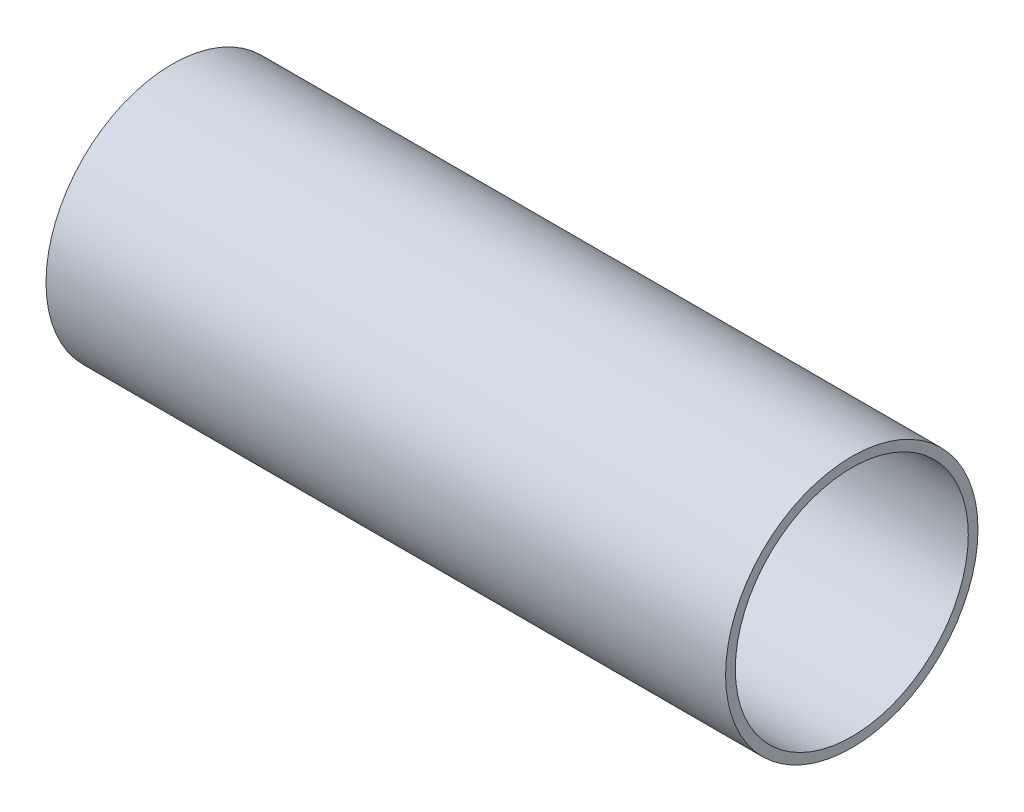
ISO-10303-21;
HEADER;
FILE_DESCRIPTION(('STEP AP214'),'2;1');
FILE_NAME('part.step','',(''),(''),'','','');
FILE_SCHEMA(('AUTOMOTIVE_DESIGN { 1 0 10303 214 1 1 1 1 }'));
ENDSEC;
DATA;
#1=APPLICATION_CONTEXT('core data for automotive mechanical design processes');
#2=APPLICATION_PROTOCOL_DEFINITION('international standard','automotive_design',2000,#1);
#3=PRODUCT_CONTEXT('',#1,'mechanical');
#4=PRODUCT('Part','Part','',(#3));
#5=PRODUCT_RELATED_PRODUCT_CATEGORY('part','',(#4));
#6=PRODUCT_DEFINITION_FORMATION('','',#4);
#7=PRODUCT_DEFINITION_CONTEXT('part definition',#1,'design');
#8=PRODUCT_DEFINITION('design','',#6,#7);
#9=PRODUCT_DEFINITION_SHAPE('','',#8);
#10=(LENGTH_UNIT() NAMED_UNIT(*) SI_UNIT(.MILLI.,.METRE.));
#11=(NAMED_UNIT(*) PLANE_ANGLE_UNIT() SI_UNIT($,.RADIAN.));
#12=(NAMED_UNIT(*) SI_UNIT($,.STERADIAN.) SOLID_ANGLE_UNIT());
#13=UNCERTAINTY_MEASURE_WITH_UNIT(LENGTH_MEASURE(1.E-05),#10,'distance_accuracy_value','');
#14=(GEOMETRIC_REPRESENTATION_CONTEXT(3) GLOBAL_UNCERTAINTY_ASSIGNED_CONTEXT((#13)) GLOBAL_UNIT_ASSIGNED_CONTEXT((#10,
#11,#12)) REPRESENTATION_CONTEXT('',''));
#15=CARTESIAN_POINT('',(0.,0.,0.));
#16=DIRECTION('',(0.,0.,1.));
#17=DIRECTION('',(1.,0.,0.));
#18=AXIS2_PLACEMENT_3D('',#15,#16,#17);
#19=CARTESIAN_POINT('',(350.,0.,0.));
#20=DIRECTION('',(1.,0.,0.));
#21=DIRECTION('',(0.,0.,-1.));
#22=AXIS2_PLACEMENT_3D('',#19,#20,#21);
#23=PLANE('',#22);
#24=CARTESIAN_POINT('',(350.,0.,0.));
#25=DIRECTION('',(1.,0.,0.));
#26=DIRECTION('',(0.,0.,-1.));
#27=AXIS2_PLACEMENT_3D('',#24,#25,#26);
#28=CIRCLE('',#27,65.);
#29=CARTESIAN_POINT('',(350.,0.,-65.));
#30=VERTEX_POINT('',#29);
#31=EDGE_CURVE('E10',#30,#30,#28,.T.);
#32=ORIENTED_EDGE('',*,*,#31,.T.);
#33=EDGE_LOOP('',(#32));
#34=FACE_BOUND('',#33,.T.);
#35=CARTESIAN_POINT('',(350.,0.,0.));
#36=DIRECTION('',(1.,0.,0.));
#37=DIRECTION('',(0.,0.,-1.));
#38=AXIS2_PLACEMENT_3D('',#35,#36,#37);
#39=CIRCLE('',#38,60.);
#40=CARTESIAN_POINT('',(350.,0.,-60.));
#41=VERTEX_POINT('',#40);
#42=EDGE_CURVE('E44',#41,#41,#39,.T.);
#43=ORIENTED_EDGE('',*,*,#42,.F.);
#44=EDGE_LOOP('',(#43));
#45=FACE_BOUND('',#44,.T.);
#46=ADVANCED_FACE('F33',(#34,#45),#23,.T.);
#47=CARTESIAN_POINT('',(0.,0.,0.));
#48=DIRECTION('',(1.,0.,0.));
#49=DIRECTION('',(0.,0.,-1.));
#50=AXIS2_PLACEMENT_3D('',#47,#48,#49);
#51=PLANE('',#50);
#52=CARTESIAN_POINT('',(0.,0.,0.));
#53=DIRECTION('',(1.,0.,0.));
#54=DIRECTION('',(0.,0.,-1.));
#55=AXIS2_PLACEMENT_3D('',#52,#53,#54);
#56=CIRCLE('',#55,65.);
#57=CARTESIAN_POINT('',(0.,0.,-65.));
#58=VERTEX_POINT('',#57);
#59=EDGE_CURVE('E37',#58,#58,#56,.T.);
#60=ORIENTED_EDGE('',*,*,#59,.F.);
#61=EDGE_LOOP('',(#60));
#62=FACE_BOUND('',#61,.T.);
#63=CARTESIAN_POINT('',(0.,0.,0.));
#64=DIRECTION('',(1.,0.,0.));
#65=DIRECTION('',(0.,0.,-1.));
#66=AXIS2_PLACEMENT_3D('',#63,#64,#65);
#67=CIRCLE('',#66,60.);
#68=CARTESIAN_POINT('',(0.,0.,-60.));
#69=VERTEX_POINT('',#68);
#70=EDGE_CURVE('E46',#69,#69,#67,.T.);
#71=ORIENTED_EDGE('',*,*,#70,.T.);
#72=EDGE_LOOP('',(#71));
#73=FACE_BOUND('',#72,.T.);
#74=ADVANCED_FACE('F56',(#62,#73),#51,.F.);
#75=CARTESIAN_POINT('',(350.,0.,0.));
#76=DIRECTION('',(-1.,0.,0.));
#77=DIRECTION('',(0.,0.,1.));
#78=AXIS2_PLACEMENT_3D('',#75,#76,#77);
#79=CYLINDRICAL_SURFACE('',#78,65.);
#80=ORIENTED_EDGE('',*,*,#31,.F.);
#81=EDGE_LOOP('',(#80));
#82=FACE_BOUND('',#81,.T.);
#83=ORIENTED_EDGE('',*,*,#59,.T.);
#84=EDGE_LOOP('',(#83));
#85=FACE_BOUND('',#84,.T.);
#86=ADVANCED_FACE('F35',(#82,#85),#79,.T.);
#87=CARTESIAN_POINT('',(350.,0.,0.));
#88=DIRECTION('',(-1.,0.,0.));
#89=DIRECTION('',(0.,0.,1.));
#90=AXIS2_PLACEMENT_3D('',#87,#88,#89);
#91=CYLINDRICAL_SURFACE('',#90,60.);
#92=ORIENTED_EDGE('',*,*,#42,.T.);
#93=EDGE_LOOP('',(#92));
#94=FACE_BOUND('',#93,.T.);
#95=ORIENTED_EDGE('',*,*,#70,.F.);
#96=EDGE_LOOP('',(#95));
#97=FACE_BOUND('',#96,.T.);
#98=ADVANCED_FACE('F52',(#94,#97),#91,.F.);
#99=CLOSED_SHELL('',(#46,#74,#86,#98));
#100=MANIFOLD_SOLID_BREP('B2',#99);
#101=ADVANCED_BREP_SHAPE_REPRESENTATION('',(#18,#100),#14);
#102=SHAPE_DEFINITION_REPRESENTATION(#9,#101);
ENDSEC;
END-ISO-10303-21;
